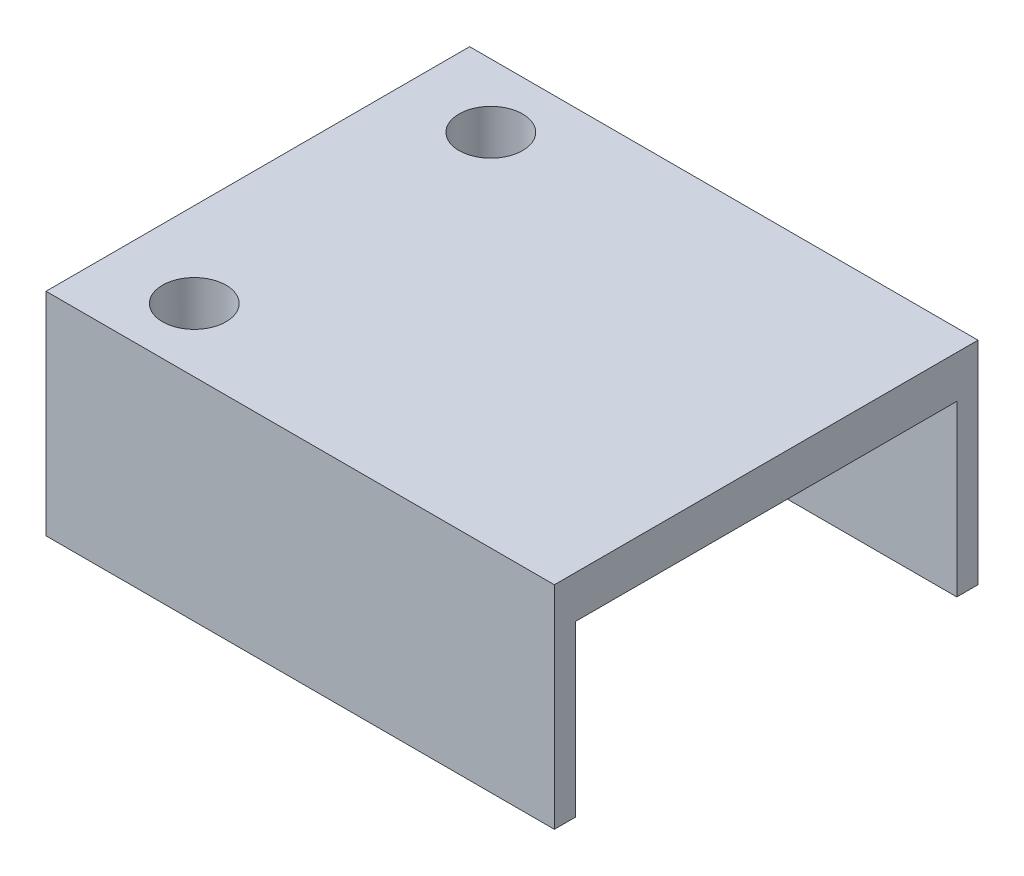
ISO-10303-21;
HEADER;
FILE_DESCRIPTION(('STEP AP214'),'2;1');
FILE_NAME('part.step','',(''),(''),'','','');
FILE_SCHEMA(('AUTOMOTIVE_DESIGN { 1 0 10303 214 1 1 1 1 }'));
ENDSEC;
DATA;
#1=APPLICATION_CONTEXT('core data for automotive mechanical design processes');
#2=APPLICATION_PROTOCOL_DEFINITION('international standard','automotive_design',2000,#1);
#3=PRODUCT_CONTEXT('',#1,'mechanical');
#4=PRODUCT('Part','Part','',(#3));
#5=PRODUCT_RELATED_PRODUCT_CATEGORY('part','',(#4));
#6=PRODUCT_DEFINITION_FORMATION('','',#4);
#7=PRODUCT_DEFINITION_CONTEXT('part definition',#1,'design');
#8=PRODUCT_DEFINITION('design','',#6,#7);
#9=PRODUCT_DEFINITION_SHAPE('','',#8);
#10=(LENGTH_UNIT() NAMED_UNIT(*) SI_UNIT(.MILLI.,.METRE.));
#11=(NAMED_UNIT(*) PLANE_ANGLE_UNIT() SI_UNIT($,.RADIAN.));
#12=(NAMED_UNIT(*) SI_UNIT($,.STERADIAN.) SOLID_ANGLE_UNIT());
#13=UNCERTAINTY_MEASURE_WITH_UNIT(LENGTH_MEASURE(1.E-05),#10,'distance_accuracy_value','');
#14=(GEOMETRIC_REPRESENTATION_CONTEXT(3) GLOBAL_UNCERTAINTY_ASSIGNED_CONTEXT((#13)) GLOBAL_UNIT_ASSIGNED_CONTEXT((#10,
#11,#12)) REPRESENTATION_CONTEXT('',''));
#15=CARTESIAN_POINT('',(0.,0.,0.));
#16=DIRECTION('',(0.,0.,1.));
#17=DIRECTION('',(1.,0.,0.));
#18=AXIS2_PLACEMENT_3D('',#15,#16,#17);
#19=CARTESIAN_POINT('',(0.,0.,20.));
#20=DIRECTION('',(0.,1.,0.));
#21=DIRECTION('',(0.,0.,1.));
#22=AXIS2_PLACEMENT_3D('',#19,#20,#21);
#23=PLANE('',#22);
#24=CARTESIAN_POINT('',(2.,0.,3.));
#25=DIRECTION('',(0.,1.,0.));
#26=DIRECTION('',(0.,0.,1.));
#27=AXIS2_PLACEMENT_3D('',#24,#25,#26);
#28=CIRCLE('',#27,1.5);
#29=CARTESIAN_POINT('',(2.,0.,4.5));
#30=VERTEX_POINT('',#29);
#31=EDGE_CURVE('E219',#30,#30,#28,.T.);
#32=ORIENTED_EDGE('',*,*,#31,.T.);
#33=EDGE_LOOP('',(#32));
#34=FACE_BOUND('',#33,.T.);
#35=DIRECTION('',(1.,0.,0.));
#36=VECTOR('',#35,1.);
#37=CARTESIAN_POINT('',(4.00000000000001,0.,1.));
#38=LINE('',#37,#36);
#39=CARTESIAN_POINT('',(9.00000000000001,0.,1.));
#40=VERTEX_POINT('',#39);
#41=CARTESIAN_POINT('',(22.,0.,1.));
#42=VERTEX_POINT('',#41);
#43=EDGE_CURVE('E203',#40,#42,#38,.T.);
#44=ORIENTED_EDGE('',*,*,#43,.F.);
#45=CARTESIAN_POINT('',(9.00000000000001,0.,6.));
#46=DIRECTION('',(0.,1.,0.));
#47=DIRECTION('',(0.,0.,1.));
#48=AXIS2_PLACEMENT_3D('',#45,#46,#47);
#49=CIRCLE('',#48,5.);
#50=CARTESIAN_POINT('',(4.00625391114046,0.,5.75));
#51=VERTEX_POINT('',#50);
#52=EDGE_CURVE('E170',#40,#51,#49,.T.);
#53=ORIENTED_EDGE('',*,*,#52,.T.);
#54=DIRECTION('',(-1.,0.,0.));
#55=VECTOR('',#54,1.);
#56=CARTESIAN_POINT('',(6.,0.,5.75));
#57=LINE('',#56,#55);
#58=CARTESIAN_POINT('',(-2.,0.,5.75));
#59=VERTEX_POINT('',#58);
#60=EDGE_CURVE('E154',#51,#59,#57,.T.);
#61=ORIENTED_EDGE('',*,*,#60,.T.);
#62=DIRECTION('',(0.,0.,1.));
#63=VECTOR('',#62,1.);
#64=CARTESIAN_POINT('',(-2.,0.,20.));
#65=LINE('',#64,#63);
#66=CARTESIAN_POINT('',(-2.,0.,0.));
#67=VERTEX_POINT('',#66);
#68=EDGE_CURVE('E168',#67,#59,#65,.T.);
#69=ORIENTED_EDGE('',*,*,#68,.F.);
#70=DIRECTION('',(1.,0.,0.));
#71=VECTOR('',#70,1.);
#72=CARTESIAN_POINT('',(0.,0.,0.));
#73=LINE('',#72,#71);
#74=CARTESIAN_POINT('',(22.,0.,0.));
#75=VERTEX_POINT('',#74);
#76=EDGE_CURVE('E223',#67,#75,#73,.T.);
#77=ORIENTED_EDGE('',*,*,#76,.T.);
#78=DIRECTION('',(0.,0.,-1.));
#79=VECTOR('',#78,1.);
#80=CARTESIAN_POINT('',(22.,0.,20.));
#81=LINE('',#80,#79);
#82=EDGE_CURVE('E241',#42,#75,#81,.T.);
#83=ORIENTED_EDGE('',*,*,#82,.F.);
#84=EDGE_LOOP('',(#44,#53,#61,#69,#77,#83));
#85=FACE_BOUND('',#84,.T.);
#86=ADVANCED_FACE('F39',(#34,#85),#23,.F.);
#87=CARTESIAN_POINT('',(-2.,0.,14.25));
#88=VERTEX_POINT('',#87);
#89=CARTESIAN_POINT('',(-2.,0.,20.));
#90=VERTEX_POINT('',#89);
#91=EDGE_CURVE('E181',#88,#90,#65,.T.);
#92=ORIENTED_EDGE('',*,*,#91,.F.);
#93=DIRECTION('',(-1.,0.,0.));
#94=VECTOR('',#93,1.);
#95=CARTESIAN_POINT('',(6.,0.,14.25));
#96=LINE('',#95,#94);
#97=CARTESIAN_POINT('',(4.00625391114046,0.,14.25));
#98=VERTEX_POINT('',#97);
#99=EDGE_CURVE('E53',#98,#88,#96,.T.);
#100=ORIENTED_EDGE('',*,*,#99,.F.);
#101=CARTESIAN_POINT('',(9.00000000000001,0.,14.));
#102=DIRECTION('',(0.,1.,0.));
#103=DIRECTION('',(0.,0.,1.));
#104=AXIS2_PLACEMENT_3D('',#101,#102,#103);
#105=CIRCLE('',#104,5.);
#106=CARTESIAN_POINT('',(9.00000000000001,0.,19.));
#107=VERTEX_POINT('',#106);
#108=EDGE_CURVE('E11',#98,#107,#105,.T.);
#109=ORIENTED_EDGE('',*,*,#108,.T.);
#110=DIRECTION('',(1.,0.,0.));
#111=VECTOR('',#110,1.);
#112=CARTESIAN_POINT('',(4.00000000000001,0.,19.));
#113=LINE('',#112,#111);
#114=CARTESIAN_POINT('',(22.,0.,19.));
#115=VERTEX_POINT('',#114);
#116=EDGE_CURVE('E206',#107,#115,#113,.T.);
#117=ORIENTED_EDGE('',*,*,#116,.T.);
#118=CARTESIAN_POINT('',(22.,0.,20.));
#119=VERTEX_POINT('',#118);
#120=EDGE_CURVE('E242',#119,#115,#81,.T.);
#121=ORIENTED_EDGE('',*,*,#120,.F.);
#122=DIRECTION('',(1.,0.,0.));
#123=VECTOR('',#122,1.);
#124=CARTESIAN_POINT('',(0.,0.,20.));
#125=LINE('',#124,#123);
#126=EDGE_CURVE('E224',#90,#119,#125,.T.);
#127=ORIENTED_EDGE('',*,*,#126,.F.);
#128=EDGE_LOOP('',(#92,#100,#109,#117,#121,#127));
#129=FACE_BOUND('',#128,.T.);
#130=CARTESIAN_POINT('',(2.,0.,17.));
#131=DIRECTION('',(0.,1.,0.));
#132=DIRECTION('',(0.,0.,1.));
#133=AXIS2_PLACEMENT_3D('',#130,#131,#132);
#134=CIRCLE('',#133,1.5);
#135=CARTESIAN_POINT('',(2.,0.,18.5));
#136=VERTEX_POINT('',#135);
#137=EDGE_CURVE('E212',#136,#136,#134,.T.);
#138=ORIENTED_EDGE('',*,*,#137,.T.);
#139=EDGE_LOOP('',(#138));
#140=FACE_BOUND('',#139,.T.);
#141=ADVANCED_FACE('F283',(#129,#140),#23,.F.);
#142=CARTESIAN_POINT('',(22.,0.,20.));
#143=DIRECTION('',(-1.,0.,0.));
#144=DIRECTION('',(0.,-1.,0.));
#145=AXIS2_PLACEMENT_3D('',#142,#143,#144);
#146=PLANE('',#145);
#147=DIRECTION('',(0.,0.,1.));
#148=VECTOR('',#147,1.);
#149=CARTESIAN_POINT('',(22.,8.00000000000001,1.));
#150=LINE('',#149,#148);
#151=CARTESIAN_POINT('',(22.,8.00000000000001,1.));
#152=VERTEX_POINT('',#151);
#153=CARTESIAN_POINT('',(22.,8.00000000000001,19.));
#154=VERTEX_POINT('',#153);
#155=EDGE_CURVE('E180',#152,#154,#150,.T.);
#156=ORIENTED_EDGE('',*,*,#155,.F.);
#157=DIRECTION('',(0.,1.,0.));
#158=VECTOR('',#157,1.);
#159=CARTESIAN_POINT('',(22.,8.00000000000001,1.));
#160=LINE('',#159,#158);
#161=EDGE_CURVE('E193',#42,#152,#160,.T.);
#162=ORIENTED_EDGE('',*,*,#161,.F.);
#163=ORIENTED_EDGE('',*,*,#82,.T.);
#164=DIRECTION('',(0.,1.,0.));
#165=VECTOR('',#164,1.);
#166=CARTESIAN_POINT('',(22.,0.,0.));
#167=LINE('',#166,#165);
#168=CARTESIAN_POINT('',(22.,10.,0.));
#169=VERTEX_POINT('',#168);
#170=EDGE_CURVE('E235',#75,#169,#167,.T.);
#171=ORIENTED_EDGE('',*,*,#170,.T.);
#172=DIRECTION('',(0.,0.,-1.));
#173=VECTOR('',#172,1.);
#174=CARTESIAN_POINT('',(22.,10.,20.));
#175=LINE('',#174,#173);
#176=CARTESIAN_POINT('',(22.,10.,20.));
#177=VERTEX_POINT('',#176);
#178=EDGE_CURVE('E232',#177,#169,#175,.T.);
#179=ORIENTED_EDGE('',*,*,#178,.F.);
#180=DIRECTION('',(0.,1.,0.));
#181=VECTOR('',#180,1.);
#182=CARTESIAN_POINT('',(22.,0.,20.));
#183=LINE('',#182,#181);
#184=EDGE_CURVE('E226',#119,#177,#183,.T.);
#185=ORIENTED_EDGE('',*,*,#184,.F.);
#186=ORIENTED_EDGE('',*,*,#120,.T.);
#187=DIRECTION('',(0.,-1.,0.));
#188=VECTOR('',#187,1.);
#189=CARTESIAN_POINT('',(22.,8.00000000000001,19.));
#190=LINE('',#189,#188);
#191=EDGE_CURVE('E184',#154,#115,#190,.T.);
#192=ORIENTED_EDGE('',*,*,#191,.F.);
#193=EDGE_LOOP('',(#156,#162,#163,#171,#179,#185,#186,#192));
#194=FACE_BOUND('',#193,.T.);
#195=ADVANCED_FACE('F293',(#194),#146,.F.);
#196=CARTESIAN_POINT('',(0.,10.,20.));
#197=DIRECTION('',(0.,-1.,0.));
#198=DIRECTION('',(0.,0.,-1.));
#199=AXIS2_PLACEMENT_3D('',#196,#197,#198);
#200=PLANE('',#199);
#201=CARTESIAN_POINT('',(2.,10.,17.));
#202=DIRECTION('',(0.,1.,0.));
#203=DIRECTION('',(0.,0.,-1.));
#204=AXIS2_PLACEMENT_3D('',#201,#202,#203);
#205=CIRCLE('',#204,1.5);
#206=CARTESIAN_POINT('',(2.,10.,15.5));
#207=VERTEX_POINT('',#206);
#208=EDGE_CURVE('E202',#207,#207,#205,.T.);
#209=ORIENTED_EDGE('',*,*,#208,.F.);
#210=EDGE_LOOP('',(#209));
#211=FACE_BOUND('',#210,.T.);
#212=CARTESIAN_POINT('',(2.,10.,3.));
#213=DIRECTION('',(0.,1.,0.));
#214=DIRECTION('',(0.,0.,1.));
#215=AXIS2_PLACEMENT_3D('',#212,#213,#214);
#216=CIRCLE('',#215,1.5);
#217=CARTESIAN_POINT('',(2.,10.,4.5));
#218=VERTEX_POINT('',#217);
#219=EDGE_CURVE('E215',#218,#218,#216,.T.);
#220=ORIENTED_EDGE('',*,*,#219,.F.);
#221=EDGE_LOOP('',(#220));
#222=FACE_BOUND('',#221,.T.);
#223=DIRECTION('',(-1.,0.,0.));
#224=VECTOR('',#223,1.);
#225=CARTESIAN_POINT('',(0.,10.,0.));
#226=LINE('',#225,#224);
#227=CARTESIAN_POINT('',(-2.,10.,0.));
#228=VERTEX_POINT('',#227);
#229=EDGE_CURVE('E227',#169,#228,#226,.T.);
#230=ORIENTED_EDGE('',*,*,#229,.T.);
#231=DIRECTION('',(0.,0.,-1.));
#232=VECTOR('',#231,1.);
#233=CARTESIAN_POINT('',(-2.,10.,20.));
#234=LINE('',#233,#232);
#235=CARTESIAN_POINT('',(-2.,10.,20.));
#236=VERTEX_POINT('',#235);
#237=EDGE_CURVE('E304',#236,#228,#234,.T.);
#238=ORIENTED_EDGE('',*,*,#237,.F.);
#239=DIRECTION('',(-1.,0.,0.));
#240=VECTOR('',#239,1.);
#241=CARTESIAN_POINT('',(0.,10.,20.));
#242=LINE('',#241,#240);
#243=EDGE_CURVE('E229',#177,#236,#242,.T.);
#244=ORIENTED_EDGE('',*,*,#243,.F.);
#245=ORIENTED_EDGE('',*,*,#178,.T.);
#246=EDGE_LOOP('',(#230,#238,#244,#245));
#247=FACE_BOUND('',#246,.T.);
#248=ADVANCED_FACE('F339',(#211,#222,#247),#200,.F.);
#249=CARTESIAN_POINT('',(0.,0.,20.));
#250=DIRECTION('',(0.,0.,-1.));
#251=DIRECTION('',(-1.,0.,0.));
#252=AXIS2_PLACEMENT_3D('',#249,#250,#251);
#253=PLANE('',#252);
#254=ORIENTED_EDGE('',*,*,#243,.T.);
#255=DIRECTION('',(0.,1.,0.));
#256=VECTOR('',#255,1.);
#257=CARTESIAN_POINT('',(-2.,0.,20.));
#258=LINE('',#257,#256);
#259=EDGE_CURVE('E299',#90,#236,#258,.T.);
#260=ORIENTED_EDGE('',*,*,#259,.F.);
#261=ORIENTED_EDGE('',*,*,#126,.T.);
#262=ORIENTED_EDGE('',*,*,#184,.T.);
#263=EDGE_LOOP('',(#254,#260,#261,#262));
#264=FACE_BOUND('',#263,.T.);
#265=ADVANCED_FACE('F300',(#264),#253,.F.);
#266=CARTESIAN_POINT('',(0.,0.,0.));
#267=DIRECTION('',(0.,0.,-1.));
#268=DIRECTION('',(-1.,0.,0.));
#269=AXIS2_PLACEMENT_3D('',#266,#267,#268);
#270=PLANE('',#269);
#271=ORIENTED_EDGE('',*,*,#76,.F.);
#272=DIRECTION('',(0.,-1.,0.));
#273=VECTOR('',#272,1.);
#274=CARTESIAN_POINT('',(-2.,0.,0.));
#275=LINE('',#274,#273);
#276=EDGE_CURVE('E179',#228,#67,#275,.T.);
#277=ORIENTED_EDGE('',*,*,#276,.F.);
#278=ORIENTED_EDGE('',*,*,#229,.F.);
#279=ORIENTED_EDGE('',*,*,#170,.F.);
#280=EDGE_LOOP('',(#271,#277,#278,#279));
#281=FACE_BOUND('',#280,.T.);
#282=ADVANCED_FACE('F337',(#281),#270,.T.);
#283=CARTESIAN_POINT('',(2.,-10.,3.));
#284=DIRECTION('',(0.,1.,0.));
#285=DIRECTION('',(0.,0.,1.));
#286=AXIS2_PLACEMENT_3D('',#283,#284,#285);
#287=CYLINDRICAL_SURFACE('',#286,1.5);
#288=ORIENTED_EDGE('',*,*,#219,.T.);
#289=EDGE_LOOP('',(#288));
#290=FACE_BOUND('',#289,.T.);
#291=ORIENTED_EDGE('',*,*,#31,.F.);
#292=EDGE_LOOP('',(#291));
#293=FACE_BOUND('',#292,.T.);
#294=ADVANCED_FACE('F384',(#290,#293),#287,.F.);
#295=CARTESIAN_POINT('',(2.,-10.,17.));
#296=DIRECTION('',(0.,1.,0.));
#297=DIRECTION('',(0.,0.,1.));
#298=AXIS2_PLACEMENT_3D('',#295,#296,#297);
#299=CYLINDRICAL_SURFACE('',#298,1.5);
#300=ORIENTED_EDGE('',*,*,#208,.T.);
#301=EDGE_LOOP('',(#300));
#302=FACE_BOUND('',#301,.T.);
#303=ORIENTED_EDGE('',*,*,#137,.F.);
#304=EDGE_LOOP('',(#303));
#305=FACE_BOUND('',#304,.T.);
#306=ADVANCED_FACE('F377',(#302,#305),#299,.F.);
#307=CARTESIAN_POINT('',(4.,7.99999999999999,1.));
#308=DIRECTION('',(0.,1.,0.));
#309=DIRECTION('',(-1.,0.,0.));
#310=AXIS2_PLACEMENT_3D('',#307,#308,#309);
#311=PLANE('',#310);
#312=DIRECTION('',(0.,0.,1.));
#313=VECTOR('',#312,1.);
#314=CARTESIAN_POINT('',(4.,7.99999999999999,1.));
#315=LINE('',#314,#313);
#316=CARTESIAN_POINT('',(4.,7.99999999999999,6.));
#317=VERTEX_POINT('',#316);
#318=CARTESIAN_POINT('',(4.,7.99999999999999,14.));
#319=VERTEX_POINT('',#318);
#320=EDGE_CURVE('E189',#317,#319,#315,.T.);
#321=ORIENTED_EDGE('',*,*,#320,.F.);
#322=CARTESIAN_POINT('',(9.,8.,6.));
#323=DIRECTION('',(0.,1.,0.));
#324=DIRECTION('',(-1.,0.,0.));
#325=AXIS2_PLACEMENT_3D('',#322,#323,#324);
#326=CIRCLE('',#325,5.);
#327=CARTESIAN_POINT('',(9.,8.,1.));
#328=VERTEX_POINT('',#327);
#329=EDGE_CURVE('E256',#317,#328,#326,.F.);
#330=ORIENTED_EDGE('',*,*,#329,.T.);
#331=DIRECTION('',(1.,0.,0.));
#332=VECTOR('',#331,1.);
#333=CARTESIAN_POINT('',(4.,7.99999999999999,1.));
#334=LINE('',#333,#332);
#335=EDGE_CURVE('E199',#328,#152,#334,.T.);
#336=ORIENTED_EDGE('',*,*,#335,.T.);
#337=ORIENTED_EDGE('',*,*,#155,.T.);
#338=DIRECTION('',(1.,0.,0.));
#339=VECTOR('',#338,1.);
#340=CARTESIAN_POINT('',(4.,7.99999999999999,19.));
#341=LINE('',#340,#339);
#342=CARTESIAN_POINT('',(9.,8.,19.));
#343=VERTEX_POINT('',#342);
#344=EDGE_CURVE('E192',#343,#154,#341,.T.);
#345=ORIENTED_EDGE('',*,*,#344,.F.);
#346=CARTESIAN_POINT('',(9.,8.,14.));
#347=DIRECTION('',(0.,1.,0.));
#348=DIRECTION('',(-1.,0.,0.));
#349=AXIS2_PLACEMENT_3D('',#346,#347,#348);
#350=CIRCLE('',#349,5.);
#351=EDGE_CURVE('E253',#343,#319,#350,.F.);
#352=ORIENTED_EDGE('',*,*,#351,.T.);
#353=EDGE_LOOP('',(#321,#330,#336,#337,#345,#352));
#354=FACE_BOUND('',#353,.T.);
#355=ADVANCED_FACE('F329',(#354),#311,.F.);
#356=CARTESIAN_POINT('',(4.,7.99999999999999,1.));
#357=DIRECTION('',(0.,0.,-1.));
#358=DIRECTION('',(0.,1.,0.));
#359=AXIS2_PLACEMENT_3D('',#356,#357,#358);
#360=PLANE('',#359);
#361=ORIENTED_EDGE('',*,*,#335,.F.);
#362=DIRECTION('',(0.,1.,0.));
#363=VECTOR('',#362,1.);
#364=CARTESIAN_POINT('',(9.,8.,1.));
#365=LINE('',#364,#363);
#366=EDGE_CURVE('E259',#328,#40,#365,.F.);
#367=ORIENTED_EDGE('',*,*,#366,.T.);
#368=ORIENTED_EDGE('',*,*,#43,.T.);
#369=ORIENTED_EDGE('',*,*,#161,.T.);
#370=EDGE_LOOP('',(#361,#367,#368,#369));
#371=FACE_BOUND('',#370,.T.);
#372=ADVANCED_FACE('F369',(#371),#360,.F.);
#373=CARTESIAN_POINT('',(4.,7.99999999999999,19.));
#374=DIRECTION('',(0.,0.,1.));
#375=DIRECTION('',(1.,0.,0.));
#376=AXIS2_PLACEMENT_3D('',#373,#374,#375);
#377=PLANE('',#376);
#378=ORIENTED_EDGE('',*,*,#116,.F.);
#379=DIRECTION('',(0.,-1.,0.));
#380=VECTOR('',#379,1.);
#381=CARTESIAN_POINT('',(9.,8.,19.));
#382=LINE('',#381,#380);
#383=EDGE_CURVE('E262',#107,#343,#382,.F.);
#384=ORIENTED_EDGE('',*,*,#383,.T.);
#385=ORIENTED_EDGE('',*,*,#344,.T.);
#386=ORIENTED_EDGE('',*,*,#191,.T.);
#387=EDGE_LOOP('',(#378,#384,#385,#386));
#388=FACE_BOUND('',#387,.T.);
#389=ADVANCED_FACE('F287',(#388),#377,.F.);
#390=CARTESIAN_POINT('',(4.00000000000001,0.,0.));
#391=DIRECTION('',(1.,0.,0.));
#392=DIRECTION('',(0.,1.,0.));
#393=AXIS2_PLACEMENT_3D('',#390,#391,#392);
#394=PLANE('',#393);
#395=DIRECTION('',(0.,0.,1.));
#396=VECTOR('',#395,1.);
#397=CARTESIAN_POINT('',(4.,7.09040621333656,0.));
#398=LINE('',#397,#396);
#399=CARTESIAN_POINT('',(4.,7.09040621333656,6.));
#400=VERTEX_POINT('',#399);
#401=CARTESIAN_POINT('',(4.,7.09040621333657,14.));
#402=VERTEX_POINT('',#401);
#403=EDGE_CURVE('E305',#400,#402,#398,.T.);
#404=ORIENTED_EDGE('',*,*,#403,.F.);
#405=DIRECTION('',(0.,1.,0.));
#406=VECTOR('',#405,1.);
#407=CARTESIAN_POINT('',(4.00000000000001,0.,6.));
#408=LINE('',#407,#406);
#409=EDGE_CURVE('E249',#400,#317,#408,.T.);
#410=ORIENTED_EDGE('',*,*,#409,.T.);
#411=ORIENTED_EDGE('',*,*,#320,.T.);
#412=DIRECTION('',(0.,-1.,0.));
#413=VECTOR('',#412,1.);
#414=CARTESIAN_POINT('',(4.00000000000001,0.,14.));
#415=LINE('',#414,#413);
#416=EDGE_CURVE('E245',#319,#402,#415,.T.);
#417=ORIENTED_EDGE('',*,*,#416,.T.);
#418=EDGE_LOOP('',(#404,#410,#411,#417));
#419=FACE_BOUND('',#418,.T.);
#420=ADVANCED_FACE('F325',(#419),#394,.T.);
#421=CARTESIAN_POINT('',(-2.,0.,0.));
#422=DIRECTION('',(-1.,0.,0.));
#423=DIRECTION('',(0.,0.,1.));
#424=AXIS2_PLACEMENT_3D('',#421,#422,#423);
#425=PLANE('',#424);
#426=DIRECTION('',(0.,-1.,0.));
#427=VECTOR('',#426,1.);
#428=CARTESIAN_POINT('',(-2.,7.09040621333656,5.75));
#429=LINE('',#428,#427);
#430=CARTESIAN_POINT('',(-2.,7.09040621333656,5.75));
#431=VERTEX_POINT('',#430);
#432=EDGE_CURVE('E150',#431,#59,#429,.T.);
#433=ORIENTED_EDGE('',*,*,#432,.F.);
#434=DIRECTION('',(0.,0.,-1.));
#435=VECTOR('',#434,1.);
#436=CARTESIAN_POINT('',(-2.,7.09040621333657,14.25));
#437=LINE('',#436,#435);
#438=CARTESIAN_POINT('',(-2.,7.09040621333657,14.25));
#439=VERTEX_POINT('',#438);
#440=EDGE_CURVE('E173',#439,#431,#437,.T.);
#441=ORIENTED_EDGE('',*,*,#440,.F.);
#442=DIRECTION('',(0.,1.,0.));
#443=VECTOR('',#442,1.);
#444=CARTESIAN_POINT('',(-2.,7.09040621333657,14.25));
#445=LINE('',#444,#443);
#446=EDGE_CURVE('E162',#88,#439,#445,.T.);
#447=ORIENTED_EDGE('',*,*,#446,.F.);
#448=ORIENTED_EDGE('',*,*,#91,.T.);
#449=ORIENTED_EDGE('',*,*,#259,.T.);
#450=ORIENTED_EDGE('',*,*,#237,.T.);
#451=ORIENTED_EDGE('',*,*,#276,.T.);
#452=ORIENTED_EDGE('',*,*,#68,.T.);
#453=EDGE_LOOP('',(#433,#441,#447,#448,#449,#450,#451,#452));
#454=FACE_BOUND('',#453,.T.);
#455=ADVANCED_FACE('F176',(#454),#425,.T.);
#456=CARTESIAN_POINT('',(6.,7.09040621333656,5.75));
#457=DIRECTION('',(0.,0.,-1.));
#458=DIRECTION('',(0.,1.,0.));
#459=AXIS2_PLACEMENT_3D('',#456,#457,#458);
#460=PLANE('',#459);
#461=ORIENTED_EDGE('',*,*,#60,.F.);
#462=DIRECTION('',(0.,1.,0.));
#463=VECTOR('',#462,1.);
#464=CARTESIAN_POINT('',(4.00625391114046,0.,5.75));
#465=LINE('',#464,#463);
#466=CARTESIAN_POINT('',(4.00625391114046,7.09040621333656,5.75));
#467=VERTEX_POINT('',#466);
#468=EDGE_CURVE('E266',#51,#467,#465,.T.);
#469=ORIENTED_EDGE('',*,*,#468,.T.);
#470=DIRECTION('',(-1.,0.,0.));
#471=VECTOR('',#470,1.);
#472=CARTESIAN_POINT('',(6.,7.09040621333656,5.75));
#473=LINE('',#472,#471);
#474=EDGE_CURVE('E156',#467,#431,#473,.T.);
#475=ORIENTED_EDGE('',*,*,#474,.T.);
#476=ORIENTED_EDGE('',*,*,#432,.T.);
#477=EDGE_LOOP('',(#461,#469,#475,#476));
#478=FACE_BOUND('',#477,.T.);
#479=ADVANCED_FACE('F152',(#478),#460,.F.);
#480=CARTESIAN_POINT('',(6.,7.09040621333657,14.25));
#481=DIRECTION('',(0.,1.,0.));
#482=DIRECTION('',(0.,0.,1.));
#483=AXIS2_PLACEMENT_3D('',#480,#481,#482);
#484=PLANE('',#483);
#485=ORIENTED_EDGE('',*,*,#474,.F.);
#486=CARTESIAN_POINT('',(9.,7.09040621333656,6.));
#487=DIRECTION('',(0.,1.,0.));
#488=DIRECTION('',(0.,0.,1.));
#489=AXIS2_PLACEMENT_3D('',#486,#487,#488);
#490=CIRCLE('',#489,5.);
#491=EDGE_CURVE('E269',#467,#400,#490,.T.);
#492=ORIENTED_EDGE('',*,*,#491,.T.);
#493=ORIENTED_EDGE('',*,*,#403,.T.);
#494=CARTESIAN_POINT('',(9.,7.09040621333657,14.));
#495=DIRECTION('',(0.,1.,0.));
#496=DIRECTION('',(0.,0.,1.));
#497=AXIS2_PLACEMENT_3D('',#494,#495,#496);
#498=CIRCLE('',#497,5.);
#499=CARTESIAN_POINT('',(4.00625391114046,7.09040621333657,14.25));
#500=VERTEX_POINT('',#499);
#501=EDGE_CURVE('E272',#402,#500,#498,.T.);
#502=ORIENTED_EDGE('',*,*,#501,.T.);
#503=DIRECTION('',(-1.,0.,0.));
#504=VECTOR('',#503,1.);
#505=CARTESIAN_POINT('',(6.,7.09040621333657,14.25));
#506=LINE('',#505,#504);
#507=EDGE_CURVE('E63',#500,#439,#506,.T.);
#508=ORIENTED_EDGE('',*,*,#507,.T.);
#509=ORIENTED_EDGE('',*,*,#440,.T.);
#510=EDGE_LOOP('',(#485,#492,#493,#502,#508,#509));
#511=FACE_BOUND('',#510,.T.);
#512=ADVANCED_FACE('F321',(#511),#484,.F.);
#513=CARTESIAN_POINT('',(6.,7.09040621333657,14.25));
#514=DIRECTION('',(0.,0.,1.));
#515=DIRECTION('',(0.,-1.,0.));
#516=AXIS2_PLACEMENT_3D('',#513,#514,#515);
#517=PLANE('',#516);
#518=ORIENTED_EDGE('',*,*,#507,.F.);
#519=DIRECTION('',(0.,-1.,0.));
#520=VECTOR('',#519,1.);
#521=CARTESIAN_POINT('',(4.00625391114046,7.09040621333657,14.25));
#522=LINE('',#521,#520);
#523=EDGE_CURVE('E47',#500,#98,#522,.T.);
#524=ORIENTED_EDGE('',*,*,#523,.T.);
#525=ORIENTED_EDGE('',*,*,#99,.T.);
#526=ORIENTED_EDGE('',*,*,#446,.T.);
#527=EDGE_LOOP('',(#518,#524,#525,#526));
#528=FACE_BOUND('',#527,.T.);
#529=ADVANCED_FACE('F277',(#528),#517,.F.);
#530=CARTESIAN_POINT('',(9.00000000000001,0.,6.));
#531=DIRECTION('',(0.,1.,0.));
#532=DIRECTION('',(-1.,0.,0.));
#533=AXIS2_PLACEMENT_3D('',#530,#531,#532);
#534=CYLINDRICAL_SURFACE('',#533,5.);
#535=ORIENTED_EDGE('',*,*,#52,.F.);
#536=ORIENTED_EDGE('',*,*,#366,.F.);
#537=ORIENTED_EDGE('',*,*,#329,.F.);
#538=ORIENTED_EDGE('',*,*,#409,.F.);
#539=ORIENTED_EDGE('',*,*,#491,.F.);
#540=ORIENTED_EDGE('',*,*,#468,.F.);
#541=EDGE_LOOP('',(#535,#536,#537,#538,#539,#540));
#542=FACE_BOUND('',#541,.T.);
#543=ADVANCED_FACE('F359',(#542),#534,.F.);
#544=CARTESIAN_POINT('',(9.00000000000001,0.,14.));
#545=DIRECTION('',(0.,-1.,0.));
#546=DIRECTION('',(1.,0.,0.));
#547=AXIS2_PLACEMENT_3D('',#544,#545,#546);
#548=CYLINDRICAL_SURFACE('',#547,5.);
#549=ORIENTED_EDGE('',*,*,#351,.F.);
#550=ORIENTED_EDGE('',*,*,#383,.F.);
#551=ORIENTED_EDGE('',*,*,#108,.F.);
#552=ORIENTED_EDGE('',*,*,#523,.F.);
#553=ORIENTED_EDGE('',*,*,#501,.F.);
#554=ORIENTED_EDGE('',*,*,#416,.F.);
#555=EDGE_LOOP('',(#549,#550,#551,#552,#553,#554));
#556=FACE_BOUND('',#555,.T.);
#557=ADVANCED_FACE('F41',(#556),#548,.F.);
#558=CLOSED_SHELL('',(#86,#141,#195,#248,#265,#282,#294,#306,#355,#372,#389,#420,#455,#479,#512,
#529,#543,#557));
#559=MANIFOLD_SOLID_BREP('B2',#558);
#560=ADVANCED_BREP_SHAPE_REPRESENTATION('',(#18,#559),#14);
#561=SHAPE_DEFINITION_REPRESENTATION(#9,#560);
ENDSEC;
END-ISO-10303-21;
